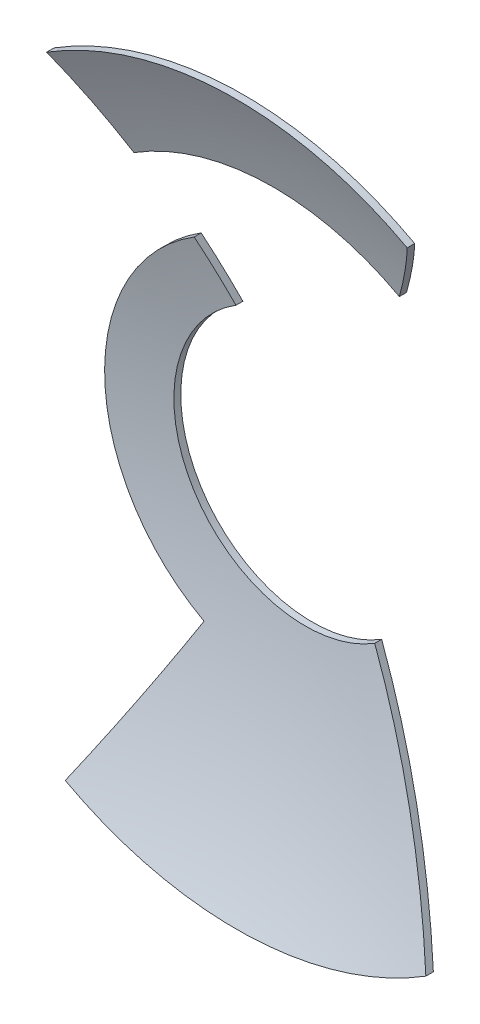
ISO-10303-21;
HEADER;
FILE_DESCRIPTION(('STEP AP214'),'2;1');
FILE_NAME('part.step','',(''),(''),'','','');
FILE_SCHEMA(('AUTOMOTIVE_DESIGN { 1 0 10303 214 1 1 1 1 }'));
ENDSEC;
DATA;
#1=APPLICATION_CONTEXT('core data for automotive mechanical design processes');
#2=APPLICATION_PROTOCOL_DEFINITION('international standard','automotive_design',2000,#1);
#3=PRODUCT_CONTEXT('',#1,'mechanical');
#4=PRODUCT('Part','Part','',(#3));
#5=PRODUCT_RELATED_PRODUCT_CATEGORY('part','',(#4));
#6=PRODUCT_DEFINITION_FORMATION('','',#4);
#7=PRODUCT_DEFINITION_CONTEXT('part definition',#1,'design');
#8=PRODUCT_DEFINITION('design','',#6,#7);
#9=PRODUCT_DEFINITION_SHAPE('','',#8);
#10=(LENGTH_UNIT() NAMED_UNIT(*) SI_UNIT(.MILLI.,.METRE.));
#11=(NAMED_UNIT(*) PLANE_ANGLE_UNIT() SI_UNIT($,.RADIAN.));
#12=(NAMED_UNIT(*) SI_UNIT($,.STERADIAN.) SOLID_ANGLE_UNIT());
#13=UNCERTAINTY_MEASURE_WITH_UNIT(LENGTH_MEASURE(1.E-05),#10,'distance_accuracy_value','');
#14=(GEOMETRIC_REPRESENTATION_CONTEXT(3) GLOBAL_UNCERTAINTY_ASSIGNED_CONTEXT((#13)) GLOBAL_UNIT_ASSIGNED_CONTEXT((#10,
#11,#12)) REPRESENTATION_CONTEXT('',''));
#15=CARTESIAN_POINT('',(0.,0.,0.));
#16=DIRECTION('',(0.,0.,1.));
#17=DIRECTION('',(1.,0.,0.));
#18=AXIS2_PLACEMENT_3D('',#15,#16,#17);
#19=CARTESIAN_POINT('',(0.,0.,0.));
#20=DIRECTION('',(0.,1.,0.));
#21=DIRECTION('',(-1.,0.,0.));
#22=AXIS2_PLACEMENT_3D('',#19,#20,#21);
#23=SPHERICAL_SURFACE('',#22,125.2);
#24=CARTESIAN_POINT('',(0.,0.,-123.707168163953));
#25=DIRECTION('',(0.,0.,1.));
#26=DIRECTION('',(1.,0.,0.));
#27=AXIS2_PLACEMENT_3D('',#24,#25,#26);
#28=CIRCLE('',#27,19.2763208329686);
#29=CARTESIAN_POINT('',(-10.1700284940749,16.3751966487503,-123.707168163953));
#30=VERTEX_POINT('',#29);
#31=CARTESIAN_POINT('',(10.1700284940749,-16.3751966487503,-123.707168163953));
#32=VERTEX_POINT('',#31);
#33=EDGE_CURVE('E65',#30,#32,#28,.T.);
#34=ORIENTED_EDGE('',*,*,#33,.F.);
#35=CARTESIAN_POINT('',(0.,0.,0.));
#36=DIRECTION('',(0.84949803391649,0.527591783836726,0.));
#37=DIRECTION('',(-0.527591783836726,0.84949803391649,0.));
#38=AXIS2_PLACEMENT_3D('',#35,#36,#37);
#39=CIRCLE('',#38,125.2);
#40=CARTESIAN_POINT('',(-14.6657046236462,23.6138765338373,-122.075148752466));
#41=VERTEX_POINT('',#40);
#42=EDGE_CURVE('E97',#41,#30,#39,.F.);
#43=ORIENTED_EDGE('',*,*,#42,.F.);
#44=CARTESIAN_POINT('',(0.,0.,-122.075148752466));
#45=DIRECTION('',(0.,0.,1.));
#46=DIRECTION('',(1.,0.,0.));
#47=AXIS2_PLACEMENT_3D('',#44,#45,#46);
#48=CIRCLE('',#47,27.7974469522536);
#49=CARTESIAN_POINT('',(-13.2240612526884,-24.4504041080817,-122.075148752466));
#50=VERTEX_POINT('',#49);
#51=EDGE_CURVE('E109',#50,#41,#48,.F.);
#52=ORIENTED_EDGE('',*,*,#51,.F.);
#53=CARTESIAN_POINT('',(0.,0.,0.));
#54=DIRECTION('',(-0.879591717544386,0.475729345770593,0.));
#55=DIRECTION('',(-0.475729345770593,-0.879591717544386,0.));
#56=AXIS2_PLACEMENT_3D('',#53,#54,#55);
#57=CIRCLE('',#56,125.2);
#58=CARTESIAN_POINT('',(-25.0649491857531,-46.3434133304251,-113.574100758936));
#59=VERTEX_POINT('',#58);
#60=EDGE_CURVE('E138',#59,#50,#57,.F.);
#61=ORIENTED_EDGE('',*,*,#60,.F.);
#62=CARTESIAN_POINT('',(0.,0.,-113.574100758936));
#63=DIRECTION('',(0.,0.,1.));
#64=DIRECTION('',(1.,0.,0.));
#65=AXIS2_PLACEMENT_3D('',#62,#63,#64);
#66=CIRCLE('',#65,52.6874144060895);
#67=CARTESIAN_POINT('',(27.7974469522536,-44.7578549501164,-113.574100758936));
#68=VERTEX_POINT('',#67);
#69=EDGE_CURVE('E141',#68,#59,#66,.F.);
#70=ORIENTED_EDGE('',*,*,#69,.F.);
#71=CARTESIAN_POINT('',(0.,0.,0.));
#72=DIRECTION('',(0.84949803391649,0.527591783836726,0.));
#73=DIRECTION('',(-0.527591783836726,0.84949803391649,0.));
#74=AXIS2_PLACEMENT_3D('',#71,#72,#73);
#75=CIRCLE('',#74,125.2);
#76=EDGE_CURVE('E135',#32,#68,#75,.F.);
#77=ORIENTED_EDGE('',*,*,#76,.F.);
#78=EDGE_LOOP('',(#34,#43,#52,#61,#70,#77));
#79=FACE_BOUND('',#78,.T.);
#80=ADVANCED_FACE('F46',(#79),#23,.F.);
#81=CARTESIAN_POINT('',(-14.6657046236462,23.6138765338373,-181.));
#82=DIRECTION('',(0.84949803391649,0.527591783836726,0.));
#83=DIRECTION('',(-0.527591783836726,0.84949803391649,0.));
#84=AXIS2_PLACEMENT_3D('',#81,#82,#83);
#85=PLANE('',#84);
#86=DIRECTION('',(0.,0.,1.));
#87=VECTOR('',#86,1.);
#88=CARTESIAN_POINT('',(-14.6657046236462,23.6138765338373,-181.));
#89=LINE('',#88,#87);
#90=CARTESIAN_POINT('',(-14.6657046236462,23.6138765338373,-123.100535916529));
#91=VERTEX_POINT('',#90);
#92=EDGE_CURVE('E100',#91,#41,#89,.T.);
#93=ORIENTED_EDGE('',*,*,#92,.T.);
#94=ORIENTED_EDGE('',*,*,#42,.T.);
#95=DIRECTION('',(0.,0.,1.));
#96=VECTOR('',#95,1.);
#97=CARTESIAN_POINT('',(-10.1700284940749,16.3751966487503,-181.));
#98=LINE('',#97,#96);
#99=CARTESIAN_POINT('',(-10.1700284940749,16.3751966487503,-124.719138287371));
#100=VERTEX_POINT('',#99);
#101=EDGE_CURVE('E134',#100,#30,#98,.T.);
#102=ORIENTED_EDGE('',*,*,#101,.F.);
#103=CARTESIAN_POINT('',(0.,0.,0.));
#104=DIRECTION('',(0.84949803391649,0.527591783836726,0.));
#105=DIRECTION('',(-0.527591783836726,0.84949803391649,0.));
#106=AXIS2_PLACEMENT_3D('',#103,#104,#105);
#107=CIRCLE('',#106,126.2);
#108=EDGE_CURVE('E104',#91,#100,#107,.F.);
#109=ORIENTED_EDGE('',*,*,#108,.F.);
#110=EDGE_LOOP('',(#93,#94,#102,#109));
#111=FACE_BOUND('',#110,.T.);
#112=ADVANCED_FACE('F102',(#111),#85,.T.);
#113=CARTESIAN_POINT('',(0.,0.,-181.));
#114=DIRECTION('',(0.,0.,1.));
#115=DIRECTION('',(1.,0.,0.));
#116=AXIS2_PLACEMENT_3D('',#113,#114,#115);
#117=CYLINDRICAL_SURFACE('',#116,27.7974469522536);
#118=DIRECTION('',(0.,0.,1.));
#119=VECTOR('',#118,1.);
#120=CARTESIAN_POINT('',(-13.2240612526884,-24.4504041080817,-181.));
#121=LINE('',#120,#119);
#122=CARTESIAN_POINT('',(-13.2240612526884,-24.4504041080817,-123.100535916529));
#123=VERTEX_POINT('',#122);
#124=EDGE_CURVE('E112',#123,#50,#121,.T.);
#125=ORIENTED_EDGE('',*,*,#124,.T.);
#126=ORIENTED_EDGE('',*,*,#51,.T.);
#127=ORIENTED_EDGE('',*,*,#92,.F.);
#128=CARTESIAN_POINT('',(0.,0.,-123.100535916529));
#129=DIRECTION('',(0.,0.,1.));
#130=DIRECTION('',(1.,0.,0.));
#131=AXIS2_PLACEMENT_3D('',#128,#129,#130);
#132=CIRCLE('',#131,27.7974469522536);
#133=EDGE_CURVE('E13',#123,#91,#132,.F.);
#134=ORIENTED_EDGE('',*,*,#133,.F.);
#135=EDGE_LOOP('',(#125,#126,#127,#134));
#136=FACE_BOUND('',#135,.T.);
#137=ADVANCED_FACE('F110',(#136),#117,.T.);
#138=CARTESIAN_POINT('',(-13.2240612526884,-24.4504041080817,-181.));
#139=DIRECTION('',(-0.879591717544386,0.475729345770593,0.));
#140=DIRECTION('',(-0.475729345770593,-0.879591717544386,0.));
#141=AXIS2_PLACEMENT_3D('',#138,#139,#140);
#142=PLANE('',#141);
#143=DIRECTION('',(0.,0.,1.));
#144=VECTOR('',#143,1.);
#145=CARTESIAN_POINT('',(-25.0649491857531,-46.3434133304251,-181.));
#146=LINE('',#145,#144);
#147=CARTESIAN_POINT('',(-25.0649491857531,-46.3434133304251,-114.675526435247));
#148=VERTEX_POINT('',#147);
#149=EDGE_CURVE('E115',#148,#59,#146,.T.);
#150=ORIENTED_EDGE('',*,*,#149,.T.);
#151=ORIENTED_EDGE('',*,*,#60,.T.);
#152=ORIENTED_EDGE('',*,*,#124,.F.);
#153=CARTESIAN_POINT('',(0.,0.,0.));
#154=DIRECTION('',(-0.879591717544386,0.475729345770593,0.));
#155=DIRECTION('',(-0.475729345770593,-0.879591717544386,0.));
#156=AXIS2_PLACEMENT_3D('',#153,#154,#155);
#157=CIRCLE('',#156,126.2);
#158=EDGE_CURVE('E56',#148,#123,#157,.F.);
#159=ORIENTED_EDGE('',*,*,#158,.F.);
#160=EDGE_LOOP('',(#150,#151,#152,#159));
#161=FACE_BOUND('',#160,.T.);
#162=ADVANCED_FACE('F154',(#161),#142,.T.);
#163=CARTESIAN_POINT('',(0.,0.,-181.));
#164=DIRECTION('',(0.,0.,1.));
#165=DIRECTION('',(1.,0.,0.));
#166=AXIS2_PLACEMENT_3D('',#163,#164,#165);
#167=CYLINDRICAL_SURFACE('',#166,52.6874144060895);
#168=DIRECTION('',(0.,0.,1.));
#169=VECTOR('',#168,1.);
#170=CARTESIAN_POINT('',(27.7974469522536,-44.7578549501164,-181.));
#171=LINE('',#170,#169);
#172=CARTESIAN_POINT('',(27.7974469522536,-44.7578549501164,-114.675526435247));
#173=VERTEX_POINT('',#172);
#174=EDGE_CURVE('E139',#173,#68,#171,.T.);
#175=ORIENTED_EDGE('',*,*,#174,.T.);
#176=ORIENTED_EDGE('',*,*,#69,.T.);
#177=ORIENTED_EDGE('',*,*,#149,.F.);
#178=CARTESIAN_POINT('',(0.,0.,-114.675526435247));
#179=DIRECTION('',(0.,0.,1.));
#180=DIRECTION('',(1.,0.,0.));
#181=AXIS2_PLACEMENT_3D('',#178,#179,#180);
#182=CIRCLE('',#181,52.6874144060895);
#183=EDGE_CURVE('E128',#173,#148,#182,.F.);
#184=ORIENTED_EDGE('',*,*,#183,.F.);
#185=EDGE_LOOP('',(#175,#176,#177,#184));
#186=FACE_BOUND('',#185,.T.);
#187=ADVANCED_FACE('F153',(#186),#167,.T.);
#188=CARTESIAN_POINT('',(10.1700284940749,-16.3751966487503,-181.));
#189=DIRECTION('',(0.84949803391649,0.527591783836726,0.));
#190=DIRECTION('',(-0.527591783836726,0.84949803391649,0.));
#191=AXIS2_PLACEMENT_3D('',#188,#189,#190);
#192=PLANE('',#191);
#193=DIRECTION('',(0.,0.,1.));
#194=VECTOR('',#193,1.);
#195=CARTESIAN_POINT('',(10.1700284940749,-16.3751966487503,-181.));
#196=LINE('',#195,#194);
#197=CARTESIAN_POINT('',(10.1700284940749,-16.3751966487503,-124.719138287371));
#198=VERTEX_POINT('',#197);
#199=EDGE_CURVE('E50',#198,#32,#196,.T.);
#200=ORIENTED_EDGE('',*,*,#199,.T.);
#201=ORIENTED_EDGE('',*,*,#76,.T.);
#202=ORIENTED_EDGE('',*,*,#174,.F.);
#203=CARTESIAN_POINT('',(0.,0.,0.));
#204=DIRECTION('',(0.84949803391649,0.527591783836726,0.));
#205=DIRECTION('',(-0.527591783836726,0.84949803391649,0.));
#206=AXIS2_PLACEMENT_3D('',#203,#204,#205);
#207=CIRCLE('',#206,126.2);
#208=EDGE_CURVE('E125',#198,#173,#207,.F.);
#209=ORIENTED_EDGE('',*,*,#208,.F.);
#210=EDGE_LOOP('',(#200,#201,#202,#209));
#211=FACE_BOUND('',#210,.T.);
#212=ADVANCED_FACE('F150',(#211),#192,.T.);
#213=CARTESIAN_POINT('',(0.,0.,-181.));
#214=DIRECTION('',(0.,0.,1.));
#215=DIRECTION('',(1.,0.,0.));
#216=AXIS2_PLACEMENT_3D('',#213,#214,#215);
#217=CYLINDRICAL_SURFACE('',#216,19.2763208329686);
#218=ORIENTED_EDGE('',*,*,#101,.T.);
#219=ORIENTED_EDGE('',*,*,#33,.T.);
#220=ORIENTED_EDGE('',*,*,#199,.F.);
#221=CARTESIAN_POINT('',(0.,0.,-124.719138287371));
#222=DIRECTION('',(0.,0.,1.));
#223=DIRECTION('',(1.,0.,0.));
#224=AXIS2_PLACEMENT_3D('',#221,#222,#223);
#225=CIRCLE('',#224,19.2763208329686);
#226=EDGE_CURVE('E122',#100,#198,#225,.T.);
#227=ORIENTED_EDGE('',*,*,#226,.F.);
#228=EDGE_LOOP('',(#218,#219,#220,#227));
#229=FACE_BOUND('',#228,.T.);
#230=ADVANCED_FACE('F156',(#229),#217,.F.);
#231=CARTESIAN_POINT('',(0.,0.,0.));
#232=DIRECTION('',(0.,1.,0.));
#233=DIRECTION('',(-1.,0.,0.));
#234=AXIS2_PLACEMENT_3D('',#231,#232,#233);
#235=SPHERICAL_SURFACE('',#234,126.2);
#236=ORIENTED_EDGE('',*,*,#108,.T.);
#237=ORIENTED_EDGE('',*,*,#226,.T.);
#238=ORIENTED_EDGE('',*,*,#208,.T.);
#239=ORIENTED_EDGE('',*,*,#183,.T.);
#240=ORIENTED_EDGE('',*,*,#158,.T.);
#241=ORIENTED_EDGE('',*,*,#133,.T.);
#242=EDGE_LOOP('',(#236,#237,#238,#239,#240,#241));
#243=FACE_BOUND('',#242,.T.);
#244=ADVANCED_FACE('F48',(#243),#235,.T.);
#245=CLOSED_SHELL('',(#80,#112,#137,#162,#187,#212,#230,#244));
#246=MANIFOLD_SOLID_BREP('B2',#245);
#247=CARTESIAN_POINT('',(0.,0.,0.));
#248=DIRECTION('',(0.,1.,0.));
#249=DIRECTION('',(-1.,0.,0.));
#250=AXIS2_PLACEMENT_3D('',#247,#248,#249);
#251=SPHERICAL_SURFACE('',#250,125.2);
#252=CARTESIAN_POINT('',(0.,0.,-119.04105364063));
#253=DIRECTION('',(0.,0.,1.));
#254=DIRECTION('',(1.,0.,0.));
#255=AXIS2_PLACEMENT_3D('',#252,#253,#254);
#256=CIRCLE('',#255,38.7848881412427);
#257=CARTESIAN_POINT('',(18.451109461219,34.1148663749225,-119.04105364063));
#258=VERTEX_POINT('',#257);
#259=CARTESIAN_POINT('',(-20.4625883203461,32.9476862216566,-119.04105364063));
#260=VERTEX_POINT('',#259);
#261=EDGE_CURVE('E44',#258,#260,#256,.T.);
#262=ORIENTED_EDGE('',*,*,#261,.F.);
#263=CARTESIAN_POINT('',(0.,0.,0.));
#264=DIRECTION('',(0.879591717544386,-0.475729345770593,0.));
#265=DIRECTION('',(0.475729345770593,0.879591717544386,0.));
#266=AXIS2_PLACEMENT_3D('',#263,#264,#265);
#267=CIRCLE('',#266,125.2);
#268=CARTESIAN_POINT('',(25.0649491857531,46.3434133304251,-113.574100758936));
#269=VERTEX_POINT('',#268);
#270=EDGE_CURVE('E284',#269,#258,#267,.F.);
#271=ORIENTED_EDGE('',*,*,#270,.F.);
#272=CARTESIAN_POINT('',(0.,0.,-113.574100758936));
#273=DIRECTION('',(0.,0.,1.));
#274=DIRECTION('',(1.,0.,0.));
#275=AXIS2_PLACEMENT_3D('',#272,#273,#274);
#276=CIRCLE('',#275,52.6874144060895);
#277=CARTESIAN_POINT('',(-27.7974469522536,44.7578549501163,-113.574100758936));
#278=VERTEX_POINT('',#277);
#279=EDGE_CURVE('E272',#278,#269,#276,.F.);
#280=ORIENTED_EDGE('',*,*,#279,.F.);
#281=CARTESIAN_POINT('',(0.,0.,0.));
#282=DIRECTION('',(-0.84949803391649,-0.527591783836726,0.));
#283=DIRECTION('',(0.527591783836726,-0.84949803391649,0.));
#284=AXIS2_PLACEMENT_3D('',#281,#282,#283);
#285=CIRCLE('',#284,125.2);
#286=EDGE_CURVE('E230',#260,#278,#285,.F.);
#287=ORIENTED_EDGE('',*,*,#286,.F.);
#288=EDGE_LOOP('',(#262,#271,#280,#287));
#289=FACE_BOUND('',#288,.T.);
#290=ADVANCED_FACE('F222',(#289),#251,.F.);
#291=CARTESIAN_POINT('',(0.,0.,-181.));
#292=DIRECTION('',(0.,0.,1.));
#293=DIRECTION('',(1.,0.,0.));
#294=AXIS2_PLACEMENT_3D('',#291,#292,#293);
#295=CYLINDRICAL_SURFACE('',#294,38.7848881412427);
#296=DIRECTION('',(0.,0.,1.));
#297=VECTOR('',#296,1.);
#298=CARTESIAN_POINT('',(18.451109461219,34.1148663749225,-181.));
#299=LINE('',#298,#297);
#300=CARTESIAN_POINT('',(18.451109461219,34.1148663749225,-120.092349680866));
#301=VERTEX_POINT('',#300);
#302=EDGE_CURVE('E237',#301,#258,#299,.T.);
#303=ORIENTED_EDGE('',*,*,#302,.T.);
#304=ORIENTED_EDGE('',*,*,#261,.T.);
#305=DIRECTION('',(0.,0.,1.));
#306=VECTOR('',#305,1.);
#307=CARTESIAN_POINT('',(-20.4625883203461,32.9476862216566,-181.));
#308=LINE('',#307,#306);
#309=CARTESIAN_POINT('',(-20.4625883203461,32.9476862216566,-120.092349680866));
#310=VERTEX_POINT('',#309);
#311=EDGE_CURVE('E265',#310,#260,#308,.T.);
#312=ORIENTED_EDGE('',*,*,#311,.F.);
#313=CARTESIAN_POINT('',(0.,0.,-120.092349680866));
#314=DIRECTION('',(0.,0.,1.));
#315=DIRECTION('',(1.,0.,0.));
#316=AXIS2_PLACEMENT_3D('',#313,#314,#315);
#317=CIRCLE('',#316,38.7848881412427);
#318=EDGE_CURVE('E279',#301,#310,#317,.T.);
#319=ORIENTED_EDGE('',*,*,#318,.F.);
#320=EDGE_LOOP('',(#303,#304,#312,#319));
#321=FACE_BOUND('',#320,.T.);
#322=ADVANCED_FACE('F295',(#321),#295,.F.);
#323=CARTESIAN_POINT('',(-27.7974469522536,44.7578549501163,-181.));
#324=DIRECTION('',(-0.84949803391649,-0.527591783836726,0.));
#325=DIRECTION('',(0.527591783836726,-0.84949803391649,0.));
#326=AXIS2_PLACEMENT_3D('',#323,#324,#325);
#327=PLANE('',#326);
#328=ORIENTED_EDGE('',*,*,#311,.T.);
#329=ORIENTED_EDGE('',*,*,#286,.T.);
#330=DIRECTION('',(0.,0.,1.));
#331=VECTOR('',#330,1.);
#332=CARTESIAN_POINT('',(-27.7974469522536,44.7578549501163,-181.));
#333=LINE('',#332,#331);
#334=CARTESIAN_POINT('',(-27.7974469522536,44.7578549501163,-114.675526435247));
#335=VERTEX_POINT('',#334);
#336=EDGE_CURVE('E274',#335,#278,#333,.T.);
#337=ORIENTED_EDGE('',*,*,#336,.F.);
#338=CARTESIAN_POINT('',(0.,0.,0.));
#339=DIRECTION('',(-0.84949803391649,-0.527591783836726,0.));
#340=DIRECTION('',(0.527591783836726,-0.84949803391649,0.));
#341=AXIS2_PLACEMENT_3D('',#338,#339,#340);
#342=CIRCLE('',#341,126.2);
#343=EDGE_CURVE('E277',#310,#335,#342,.F.);
#344=ORIENTED_EDGE('',*,*,#343,.F.);
#345=EDGE_LOOP('',(#328,#329,#337,#344));
#346=FACE_BOUND('',#345,.T.);
#347=ADVANCED_FACE('F289',(#346),#327,.T.);
#348=CARTESIAN_POINT('',(0.,0.,-181.));
#349=DIRECTION('',(0.,0.,1.));
#350=DIRECTION('',(1.,0.,0.));
#351=AXIS2_PLACEMENT_3D('',#348,#349,#350);
#352=CYLINDRICAL_SURFACE('',#351,52.6874144060895);
#353=ORIENTED_EDGE('',*,*,#336,.T.);
#354=ORIENTED_EDGE('',*,*,#279,.T.);
#355=DIRECTION('',(0.,0.,1.));
#356=VECTOR('',#355,1.);
#357=CARTESIAN_POINT('',(25.0649491857531,46.3434133304251,-181.));
#358=LINE('',#357,#356);
#359=CARTESIAN_POINT('',(25.0649491857531,46.3434133304251,-114.675526435247));
#360=VERTEX_POINT('',#359);
#361=EDGE_CURVE('E242',#360,#269,#358,.T.);
#362=ORIENTED_EDGE('',*,*,#361,.F.);
#363=CARTESIAN_POINT('',(0.,0.,-114.675526435247));
#364=DIRECTION('',(0.,0.,1.));
#365=DIRECTION('',(1.,0.,0.));
#366=AXIS2_PLACEMENT_3D('',#363,#364,#365);
#367=CIRCLE('',#366,52.6874144060895);
#368=EDGE_CURVE('E264',#335,#360,#367,.F.);
#369=ORIENTED_EDGE('',*,*,#368,.F.);
#370=EDGE_LOOP('',(#353,#354,#362,#369));
#371=FACE_BOUND('',#370,.T.);
#372=ADVANCED_FACE('F269',(#371),#352,.T.);
#373=CARTESIAN_POINT('',(25.0649491857531,46.3434133304251,-181.));
#374=DIRECTION('',(0.879591717544386,-0.475729345770593,0.));
#375=DIRECTION('',(0.475729345770593,0.879591717544386,0.));
#376=AXIS2_PLACEMENT_3D('',#373,#374,#375);
#377=PLANE('',#376);
#378=ORIENTED_EDGE('',*,*,#361,.T.);
#379=ORIENTED_EDGE('',*,*,#270,.T.);
#380=ORIENTED_EDGE('',*,*,#302,.F.);
#381=CARTESIAN_POINT('',(0.,0.,0.));
#382=DIRECTION('',(0.879591717544386,-0.475729345770593,0.));
#383=DIRECTION('',(0.475729345770593,0.879591717544386,0.));
#384=AXIS2_PLACEMENT_3D('',#381,#382,#383);
#385=CIRCLE('',#384,126.2);
#386=EDGE_CURVE('E259',#360,#301,#385,.F.);
#387=ORIENTED_EDGE('',*,*,#386,.F.);
#388=EDGE_LOOP('',(#378,#379,#380,#387));
#389=FACE_BOUND('',#388,.T.);
#390=ADVANCED_FACE('F260',(#389),#377,.T.);
#391=CARTESIAN_POINT('',(0.,0.,0.));
#392=DIRECTION('',(0.,1.,0.));
#393=DIRECTION('',(-1.,0.,0.));
#394=AXIS2_PLACEMENT_3D('',#391,#392,#393);
#395=SPHERICAL_SURFACE('',#394,126.2);
#396=ORIENTED_EDGE('',*,*,#386,.T.);
#397=ORIENTED_EDGE('',*,*,#318,.T.);
#398=ORIENTED_EDGE('',*,*,#343,.T.);
#399=ORIENTED_EDGE('',*,*,#368,.T.);
#400=EDGE_LOOP('',(#396,#397,#398,#399));
#401=FACE_BOUND('',#400,.T.);
#402=ADVANCED_FACE('F224',(#401),#395,.T.);
#403=CLOSED_SHELL('',(#290,#322,#347,#372,#390,#402));
#404=MANIFOLD_SOLID_BREP('B7',#403);
#405=ADVANCED_BREP_SHAPE_REPRESENTATION('',(#18,#246,#404),#14);
#406=SHAPE_DEFINITION_REPRESENTATION(#9,#405);
ENDSEC;
END-ISO-10303-21;
